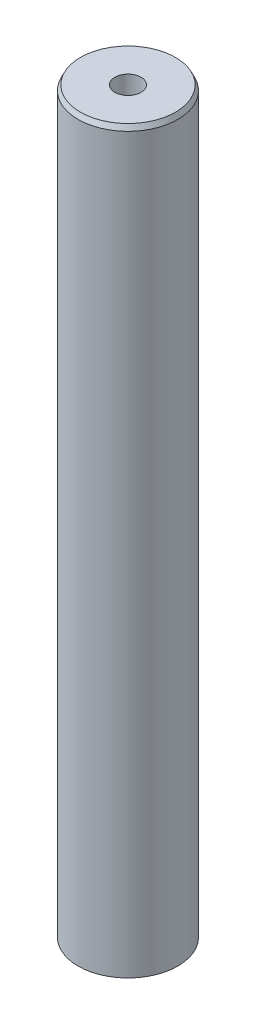
ISO-10303-21;
HEADER;
FILE_DESCRIPTION(('STEP AP214'),'2;1');
FILE_NAME('part.step','',(''),(''),'','','');
FILE_SCHEMA(('AUTOMOTIVE_DESIGN { 1 0 10303 214 1 1 1 1 }'));
ENDSEC;
DATA;
#1=APPLICATION_CONTEXT('core data for automotive mechanical design processes');
#2=APPLICATION_PROTOCOL_DEFINITION('international standard','automotive_design',2000,#1);
#3=PRODUCT_CONTEXT('',#1,'mechanical');
#4=PRODUCT('Part','Part','',(#3));
#5=PRODUCT_RELATED_PRODUCT_CATEGORY('part','',(#4));
#6=PRODUCT_DEFINITION_FORMATION('','',#4);
#7=PRODUCT_DEFINITION_CONTEXT('part definition',#1,'design');
#8=PRODUCT_DEFINITION('design','',#6,#7);
#9=PRODUCT_DEFINITION_SHAPE('','',#8);
#10=(LENGTH_UNIT() NAMED_UNIT(*) SI_UNIT(.MILLI.,.METRE.));
#11=(NAMED_UNIT(*) PLANE_ANGLE_UNIT() SI_UNIT($,.RADIAN.));
#12=(NAMED_UNIT(*) SI_UNIT($,.STERADIAN.) SOLID_ANGLE_UNIT());
#13=UNCERTAINTY_MEASURE_WITH_UNIT(LENGTH_MEASURE(1.E-05),#10,'distance_accuracy_value','');
#14=(GEOMETRIC_REPRESENTATION_CONTEXT(3) GLOBAL_UNCERTAINTY_ASSIGNED_CONTEXT((#13)) GLOBAL_UNIT_ASSIGNED_CONTEXT((#10,
#11,#12)) REPRESENTATION_CONTEXT('',''));
#15=CARTESIAN_POINT('',(0.,0.,0.));
#16=DIRECTION('',(0.,0.,1.));
#17=DIRECTION('',(1.,0.,0.));
#18=AXIS2_PLACEMENT_3D('',#15,#16,#17);
#19=CARTESIAN_POINT('',(0.,185.490475799506,0.));
#20=DIRECTION('',(0.,-1.,0.));
#21=DIRECTION('',(0.,0.,-1.));
#22=AXIS2_PLACEMENT_3D('',#19,#20,#21);
#23=CYLINDRICAL_SURFACE('',#22,12.5);
#24=CARTESIAN_POINT('',(0.,184.229492077344,0.));
#25=DIRECTION('',(0.,1.,0.));
#26=DIRECTION('',(0.,0.,1.));
#27=AXIS2_PLACEMENT_3D('',#24,#25,#26);
#28=CIRCLE('',#27,12.5);
#29=CARTESIAN_POINT('',(0.,184.229492077344,12.5));
#30=VERTEX_POINT('',#29);
#31=EDGE_CURVE('E50',#30,#30,#28,.F.);
#32=ORIENTED_EDGE('',*,*,#31,.T.);
#33=EDGE_LOOP('',(#32));
#34=FACE_BOUND('',#33,.T.);
#35=CARTESIAN_POINT('',(0.,0.602767816904493,0.));
#36=DIRECTION('',(0.,1.,0.));
#37=DIRECTION('',(0.,0.,1.));
#38=AXIS2_PLACEMENT_3D('',#35,#36,#37);
#39=CIRCLE('',#38,12.5);
#40=CARTESIAN_POINT('',(0.,0.602767816904493,12.5));
#41=VERTEX_POINT('',#40);
#42=EDGE_CURVE('E51',#41,#41,#39,.T.);
#43=ORIENTED_EDGE('',*,*,#42,.T.);
#44=EDGE_LOOP('',(#43));
#45=FACE_BOUND('',#44,.T.);
#46=ADVANCED_FACE('F39',(#34,#45),#23,.T.);
#47=CARTESIAN_POINT('',(0.,185.490475799506,0.));
#48=DIRECTION('',(0.,1.,0.));
#49=DIRECTION('',(0.,0.,1.));
#50=AXIS2_PLACEMENT_3D('',#47,#48,#49);
#51=PLANE('',#50);
#52=CARTESIAN_POINT('',(0.,185.490475799506,0.));
#53=DIRECTION('',(0.,1.,0.));
#54=DIRECTION('',(0.,0.,1.));
#55=AXIS2_PLACEMENT_3D('',#52,#53,#54);
#56=CIRCLE('',#55,11.8972321830955);
#57=CARTESIAN_POINT('',(0.,185.490475799506,11.8972321830955));
#58=VERTEX_POINT('',#57);
#59=EDGE_CURVE('E54',#58,#58,#56,.T.);
#60=ORIENTED_EDGE('',*,*,#59,.T.);
#61=EDGE_LOOP('',(#60));
#62=FACE_BOUND('',#61,.T.);
#63=CARTESIAN_POINT('',(0.,185.490475799506,0.));
#64=DIRECTION('',(0.,1.,0.));
#65=DIRECTION('',(0.,0.,1.));
#66=AXIS2_PLACEMENT_3D('',#63,#64,#65);
#67=CIRCLE('',#66,3.28226069091341);
#68=CARTESIAN_POINT('',(0.,185.490475799506,3.28226069091341));
#69=VERTEX_POINT('',#68);
#70=EDGE_CURVE('E58',#69,#69,#67,.T.);
#71=ORIENTED_EDGE('',*,*,#70,.F.);
#72=EDGE_LOOP('',(#71));
#73=FACE_BOUND('',#72,.T.);
#74=ADVANCED_FACE('F69',(#62,#73),#51,.T.);
#75=CARTESIAN_POINT('',(0.,0.,0.));
#76=DIRECTION('',(0.,1.,0.));
#77=DIRECTION('',(0.,0.,1.));
#78=AXIS2_PLACEMENT_3D('',#75,#76,#77);
#79=PLANE('',#78);
#80=CARTESIAN_POINT('',(0.,0.,0.));
#81=DIRECTION('',(0.,1.,0.));
#82=DIRECTION('',(0.,0.,1.));
#83=AXIS2_PLACEMENT_3D('',#80,#81,#82);
#84=CIRCLE('',#83,11.2390162778375);
#85=CARTESIAN_POINT('',(0.,0.,11.2390162778375));
#86=VERTEX_POINT('',#85);
#87=EDGE_CURVE('E10',#86,#86,#84,.F.);
#88=ORIENTED_EDGE('',*,*,#87,.T.);
#89=EDGE_LOOP('',(#88));
#90=FACE_BOUND('',#89,.T.);
#91=CARTESIAN_POINT('',(0.,0.,0.));
#92=DIRECTION('',(0.,1.,0.));
#93=DIRECTION('',(0.,0.,1.));
#94=AXIS2_PLACEMENT_3D('',#91,#92,#93);
#95=CIRCLE('',#94,3.28226069091341);
#96=CARTESIAN_POINT('',(0.,0.,3.28226069091341));
#97=VERTEX_POINT('',#96);
#98=EDGE_CURVE('E63',#97,#97,#95,.T.);
#99=ORIENTED_EDGE('',*,*,#98,.T.);
#100=EDGE_LOOP('',(#99));
#101=FACE_BOUND('',#100,.T.);
#102=ADVANCED_FACE('F75',(#90,#101),#79,.F.);
#103=CARTESIAN_POINT('',(0.,185.490475799506,0.));
#104=DIRECTION('',(0.,-1.,0.));
#105=DIRECTION('',(0.,0.,-1.));
#106=AXIS2_PLACEMENT_3D('',#103,#104,#105);
#107=CYLINDRICAL_SURFACE('',#106,3.28226069091341);
#108=ORIENTED_EDGE('',*,*,#70,.T.);
#109=EDGE_LOOP('',(#108));
#110=FACE_BOUND('',#109,.T.);
#111=ORIENTED_EDGE('',*,*,#98,.F.);
#112=EDGE_LOOP('',(#111));
#113=FACE_BOUND('',#112,.T.);
#114=ADVANCED_FACE('F70',(#110,#113),#107,.F.);
#115=CARTESIAN_POINT('',(0.,185.490475799506,0.));
#116=DIRECTION('',(0.,-1.,0.));
#117=DIRECTION('',(0.,0.,-1.));
#118=AXIS2_PLACEMENT_3D('',#115,#116,#117);
#119=CONICAL_SURFACE('',#118,11.8972321830955,0.445904579603213);
#120=ORIENTED_EDGE('',*,*,#31,.F.);
#121=EDGE_LOOP('',(#120));
#122=FACE_BOUND('',#121,.T.);
#123=ORIENTED_EDGE('',*,*,#59,.F.);
#124=EDGE_LOOP('',(#123));
#125=FACE_BOUND('',#124,.T.);
#126=ADVANCED_FACE('F81',(#122,#125),#119,.T.);
#127=CARTESIAN_POINT('',(0.,0.602767816904493,0.));
#128=DIRECTION('',(0.,1.,0.));
#129=DIRECTION('',(0.,0.,1.));
#130=AXIS2_PLACEMENT_3D('',#127,#128,#129);
#131=CONICAL_SURFACE('',#130,12.5,1.12489174719168);
#132=ORIENTED_EDGE('',*,*,#87,.F.);
#133=EDGE_LOOP('',(#132));
#134=FACE_BOUND('',#133,.T.);
#135=ORIENTED_EDGE('',*,*,#42,.F.);
#136=EDGE_LOOP('',(#135));
#137=FACE_BOUND('',#136,.T.);
#138=ADVANCED_FACE('F45',(#134,#137),#131,.T.);
#139=CLOSED_SHELL('',(#46,#74,#102,#114,#126,#138));
#140=MANIFOLD_SOLID_BREP('B2',#139);
#141=ADVANCED_BREP_SHAPE_REPRESENTATION('',(#18,#140),#14);
#142=SHAPE_DEFINITION_REPRESENTATION(#9,#141);
ENDSEC;
END-ISO-10303-21;
